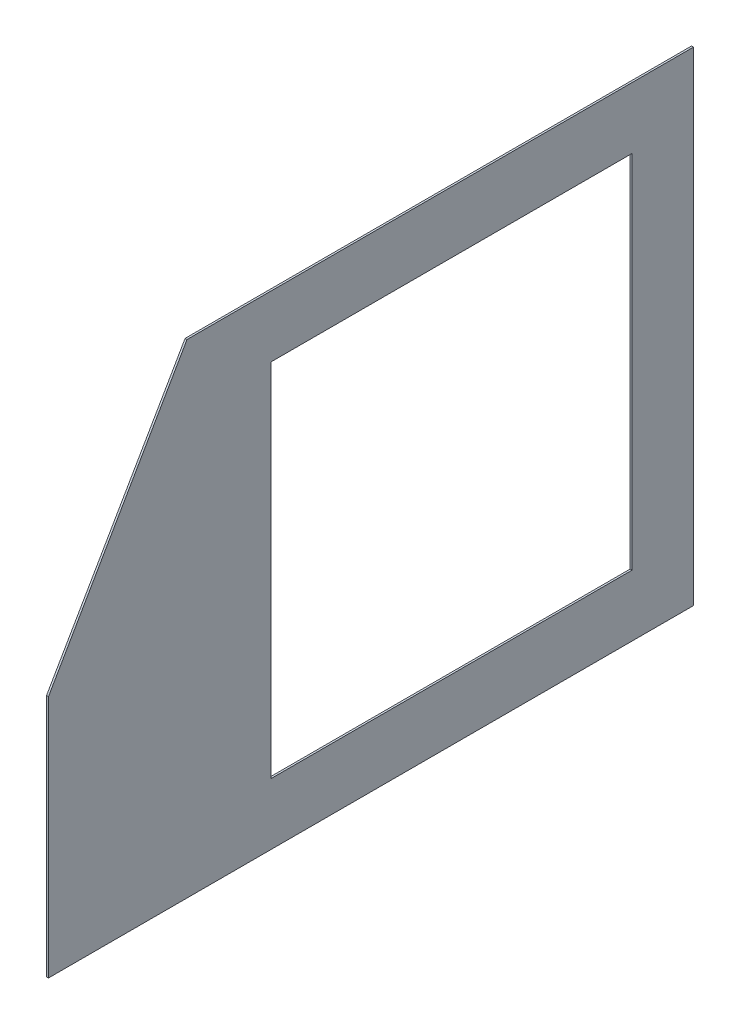
ISO-10303-21;
HEADER;
FILE_DESCRIPTION(('STEP AP214'),'2;1');
FILE_NAME('part.step','',(''),(''),'','','');
FILE_SCHEMA(('AUTOMOTIVE_DESIGN { 1 0 10303 214 1 1 1 1 }'));
ENDSEC;
DATA;
#1=APPLICATION_CONTEXT('core data for automotive mechanical design processes');
#2=APPLICATION_PROTOCOL_DEFINITION('international standard','automotive_design',2000,#1);
#3=PRODUCT_CONTEXT('',#1,'mechanical');
#4=PRODUCT('Part','Part','',(#3));
#5=PRODUCT_RELATED_PRODUCT_CATEGORY('part','',(#4));
#6=PRODUCT_DEFINITION_FORMATION('','',#4);
#7=PRODUCT_DEFINITION_CONTEXT('part definition',#1,'design');
#8=PRODUCT_DEFINITION('design','',#6,#7);
#9=PRODUCT_DEFINITION_SHAPE('','',#8);
#10=(LENGTH_UNIT() NAMED_UNIT(*) SI_UNIT(.MILLI.,.METRE.));
#11=(NAMED_UNIT(*) PLANE_ANGLE_UNIT() SI_UNIT($,.RADIAN.));
#12=(NAMED_UNIT(*) SI_UNIT($,.STERADIAN.) SOLID_ANGLE_UNIT());
#13=UNCERTAINTY_MEASURE_WITH_UNIT(LENGTH_MEASURE(1.E-05),#10,'distance_accuracy_value','');
#14=(GEOMETRIC_REPRESENTATION_CONTEXT(3) GLOBAL_UNCERTAINTY_ASSIGNED_CONTEXT((#13)) GLOBAL_UNIT_ASSIGNED_CONTEXT((#10,
#11,#12)) REPRESENTATION_CONTEXT('',''));
#15=CARTESIAN_POINT('',(0.,0.,0.));
#16=DIRECTION('',(0.,0.,1.));
#17=DIRECTION('',(1.,0.,0.));
#18=AXIS2_PLACEMENT_3D('',#15,#16,#17);
#19=CARTESIAN_POINT('',(3.175,-800.1,0.));
#20=DIRECTION('',(0.,0.,1.));
#21=DIRECTION('',(1.,0.,0.));
#22=AXIS2_PLACEMENT_3D('',#19,#20,#21);
#23=PLANE('',#22);
#24=DIRECTION('',(0.,1.,0.));
#25=VECTOR('',#24,1.);
#26=CARTESIAN_POINT('',(0.,-800.1,0.));
#27=LINE('',#26,#25);
#28=CARTESIAN_POINT('',(0.,-800.1,0.));
#29=VERTEX_POINT('',#28);
#30=CARTESIAN_POINT('',(0.,0.,0.));
#31=VERTEX_POINT('',#30);
#32=EDGE_CURVE('E117',#29,#31,#27,.T.);
#33=ORIENTED_EDGE('',*,*,#32,.T.);
#34=DIRECTION('',(-1.,0.,0.));
#35=VECTOR('',#34,1.);
#36=CARTESIAN_POINT('',(3.175,0.,0.));
#37=LINE('',#36,#35);
#38=CARTESIAN_POINT('',(3.175,0.,0.));
#39=VERTEX_POINT('',#38);
#40=EDGE_CURVE('E11',#39,#31,#37,.T.);
#41=ORIENTED_EDGE('',*,*,#40,.F.);
#42=DIRECTION('',(0.,1.,0.));
#43=VECTOR('',#42,1.);
#44=CARTESIAN_POINT('',(3.175,-800.1,0.));
#45=LINE('',#44,#43);
#46=CARTESIAN_POINT('',(3.175,-800.1,0.));
#47=VERTEX_POINT('',#46);
#48=EDGE_CURVE('E140',#47,#39,#45,.T.);
#49=ORIENTED_EDGE('',*,*,#48,.F.);
#50=DIRECTION('',(-1.,0.,0.));
#51=VECTOR('',#50,1.);
#52=CARTESIAN_POINT('',(3.175,-800.1,0.));
#53=LINE('',#52,#51);
#54=EDGE_CURVE('E152',#47,#29,#53,.T.);
#55=ORIENTED_EDGE('',*,*,#54,.T.);
#56=EDGE_LOOP('',(#33,#41,#49,#55));
#57=FACE_BOUND('',#56,.T.);
#58=ADVANCED_FACE('F33',(#57),#23,.F.);
#59=CARTESIAN_POINT('',(3.175,0.,0.));
#60=DIRECTION('',(0.,-1.,0.));
#61=DIRECTION('',(0.,0.,-1.));
#62=AXIS2_PLACEMENT_3D('',#59,#60,#61);
#63=PLANE('',#62);
#64=DIRECTION('',(0.,0.,1.));
#65=VECTOR('',#64,1.);
#66=CARTESIAN_POINT('',(0.,0.,0.));
#67=LINE('',#66,#65);
#68=CARTESIAN_POINT('',(0.,-1.02584267341776E-13,837.664111915367));
#69=VERTEX_POINT('',#68);
#70=EDGE_CURVE('E155',#31,#69,#67,.T.);
#71=ORIENTED_EDGE('',*,*,#70,.T.);
#72=DIRECTION('',(-1.,0.,0.));
#73=VECTOR('',#72,1.);
#74=CARTESIAN_POINT('',(3.175,-1.02584267341776E-13,837.664111915367));
#75=LINE('',#74,#73);
#76=CARTESIAN_POINT('',(3.175,-1.02584267341776E-13,837.664111915367));
#77=VERTEX_POINT('',#76);
#78=EDGE_CURVE('E40',#77,#69,#75,.T.);
#79=ORIENTED_EDGE('',*,*,#78,.F.);
#80=DIRECTION('',(0.,0.,1.));
#81=VECTOR('',#80,1.);
#82=CARTESIAN_POINT('',(3.175,0.,0.));
#83=LINE('',#82,#81);
#84=EDGE_CURVE('E143',#39,#77,#83,.T.);
#85=ORIENTED_EDGE('',*,*,#84,.F.);
#86=ORIENTED_EDGE('',*,*,#40,.T.);
#87=EDGE_LOOP('',(#71,#79,#85,#86));
#88=FACE_BOUND('',#87,.T.);
#89=ADVANCED_FACE('F192',(#88),#63,.F.);
#90=CARTESIAN_POINT('',(3.175,-1.02584267341776E-13,837.664111915367));
#91=DIRECTION('',(0.,-0.500000000000001,-0.866025403784438));
#92=DIRECTION('',(0.,0.866025403784438,-0.500000000000001));
#93=AXIS2_PLACEMENT_3D('',#90,#91,#92);
#94=PLANE('',#93);
#95=DIRECTION('',(0.,-0.866025403784438,0.500000000000001));
#96=VECTOR('',#95,1.);
#97=CARTESIAN_POINT('',(0.,-1.02584267341776E-13,837.664111915367));
#98=LINE('',#97,#96);
#99=CARTESIAN_POINT('',(0.,-396.875,1066.8));
#100=VERTEX_POINT('',#99);
#101=EDGE_CURVE('E157',#69,#100,#98,.T.);
#102=ORIENTED_EDGE('',*,*,#101,.T.);
#103=DIRECTION('',(-1.,0.,0.));
#104=VECTOR('',#103,1.);
#105=CARTESIAN_POINT('',(3.175,-396.875,1066.8));
#106=LINE('',#105,#104);
#107=CARTESIAN_POINT('',(3.175,-396.875,1066.8));
#108=VERTEX_POINT('',#107);
#109=EDGE_CURVE('E167',#108,#100,#106,.T.);
#110=ORIENTED_EDGE('',*,*,#109,.F.);
#111=DIRECTION('',(0.,-0.866025403784438,0.500000000000001));
#112=VECTOR('',#111,1.);
#113=CARTESIAN_POINT('',(3.175,-1.02584267341776E-13,837.664111915367));
#114=LINE('',#113,#112);
#115=EDGE_CURVE('E146',#77,#108,#114,.T.);
#116=ORIENTED_EDGE('',*,*,#115,.F.);
#117=ORIENTED_EDGE('',*,*,#78,.T.);
#118=EDGE_LOOP('',(#102,#110,#116,#117));
#119=FACE_BOUND('',#118,.T.);
#120=ADVANCED_FACE('F174',(#119),#94,.F.);
#121=CARTESIAN_POINT('',(3.175,-396.875,1066.8));
#122=DIRECTION('',(0.,0.,-1.));
#123=DIRECTION('',(-1.,0.,0.));
#124=AXIS2_PLACEMENT_3D('',#121,#122,#123);
#125=PLANE('',#124);
#126=DIRECTION('',(0.,-1.,0.));
#127=VECTOR('',#126,1.);
#128=CARTESIAN_POINT('',(0.,-396.875,1066.8));
#129=LINE('',#128,#127);
#130=CARTESIAN_POINT('',(0.,-800.1,1066.8));
#131=VERTEX_POINT('',#130);
#132=EDGE_CURVE('E159',#100,#131,#129,.T.);
#133=ORIENTED_EDGE('',*,*,#132,.T.);
#134=DIRECTION('',(-1.,0.,0.));
#135=VECTOR('',#134,1.);
#136=CARTESIAN_POINT('',(3.175,-800.1,1066.8));
#137=LINE('',#136,#135);
#138=CARTESIAN_POINT('',(3.175,-800.1,1066.8));
#139=VERTEX_POINT('',#138);
#140=EDGE_CURVE('E164',#139,#131,#137,.T.);
#141=ORIENTED_EDGE('',*,*,#140,.F.);
#142=DIRECTION('',(0.,-1.,0.));
#143=VECTOR('',#142,1.);
#144=CARTESIAN_POINT('',(3.175,-396.875,1066.8));
#145=LINE('',#144,#143);
#146=EDGE_CURVE('E148',#108,#139,#145,.T.);
#147=ORIENTED_EDGE('',*,*,#146,.F.);
#148=ORIENTED_EDGE('',*,*,#109,.T.);
#149=EDGE_LOOP('',(#133,#141,#147,#148));
#150=FACE_BOUND('',#149,.T.);
#151=ADVANCED_FACE('F182',(#150),#125,.F.);
#152=CARTESIAN_POINT('',(3.175,-800.1,1066.8));
#153=DIRECTION('',(0.,1.,0.));
#154=DIRECTION('',(0.,0.,1.));
#155=AXIS2_PLACEMENT_3D('',#152,#153,#154);
#156=PLANE('',#155);
#157=DIRECTION('',(0.,0.,-1.));
#158=VECTOR('',#157,1.);
#159=CARTESIAN_POINT('',(0.,-800.1,1066.8));
#160=LINE('',#159,#158);
#161=EDGE_CURVE('E144',#131,#29,#160,.T.);
#162=ORIENTED_EDGE('',*,*,#161,.T.);
#163=ORIENTED_EDGE('',*,*,#54,.F.);
#164=DIRECTION('',(0.,0.,-1.));
#165=VECTOR('',#164,1.);
#166=CARTESIAN_POINT('',(3.175,-800.1,1066.8));
#167=LINE('',#166,#165);
#168=EDGE_CURVE('E150',#139,#47,#167,.T.);
#169=ORIENTED_EDGE('',*,*,#168,.F.);
#170=ORIENTED_EDGE('',*,*,#140,.T.);
#171=EDGE_LOOP('',(#162,#163,#169,#170));
#172=FACE_BOUND('',#171,.T.);
#173=ADVANCED_FACE('F186',(#172),#156,.F.);
#174=CARTESIAN_POINT('',(3.175,0.,0.));
#175=DIRECTION('',(1.,0.,0.));
#176=DIRECTION('',(0.,0.,-1.));
#177=AXIS2_PLACEMENT_3D('',#174,#175,#176);
#178=PLANE('',#177);
#179=DIRECTION('',(0.,-1.,0.));
#180=VECTOR('',#179,1.);
#181=CARTESIAN_POINT('',(3.175,-101.6,698.5));
#182=LINE('',#181,#180);
#183=CARTESIAN_POINT('',(3.175,-101.6,698.5));
#184=VERTEX_POINT('',#183);
#185=CARTESIAN_POINT('',(3.175,-698.5,698.5));
#186=VERTEX_POINT('',#185);
#187=EDGE_CURVE('E47',#184,#186,#182,.T.);
#188=ORIENTED_EDGE('',*,*,#187,.F.);
#189=DIRECTION('',(0.,0.,1.));
#190=VECTOR('',#189,1.);
#191=CARTESIAN_POINT('',(3.175,-101.6,101.6));
#192=LINE('',#191,#190);
#193=CARTESIAN_POINT('',(3.175,-101.6,101.6));
#194=VERTEX_POINT('',#193);
#195=EDGE_CURVE('E111',#194,#184,#192,.T.);
#196=ORIENTED_EDGE('',*,*,#195,.F.);
#197=DIRECTION('',(0.,1.,0.));
#198=VECTOR('',#197,1.);
#199=CARTESIAN_POINT('',(3.175,-396.875,101.6));
#200=LINE('',#199,#198);
#201=CARTESIAN_POINT('',(3.175,-698.5,101.6));
#202=VERTEX_POINT('',#201);
#203=EDGE_CURVE('E131',#202,#194,#200,.T.);
#204=ORIENTED_EDGE('',*,*,#203,.F.);
#205=DIRECTION('',(0.,0.,-1.));
#206=VECTOR('',#205,1.);
#207=CARTESIAN_POINT('',(3.175,-698.5,698.5));
#208=LINE('',#207,#206);
#209=EDGE_CURVE('E125',#186,#202,#208,.T.);
#210=ORIENTED_EDGE('',*,*,#209,.F.);
#211=EDGE_LOOP('',(#188,#196,#204,#210));
#212=FACE_BOUND('',#211,.T.);
#213=ORIENTED_EDGE('',*,*,#48,.T.);
#214=ORIENTED_EDGE('',*,*,#84,.T.);
#215=ORIENTED_EDGE('',*,*,#115,.T.);
#216=ORIENTED_EDGE('',*,*,#146,.T.);
#217=ORIENTED_EDGE('',*,*,#168,.T.);
#218=EDGE_LOOP('',(#213,#214,#215,#216,#217));
#219=FACE_BOUND('',#218,.T.);
#220=ADVANCED_FACE('F190',(#212,#219),#178,.T.);
#221=CARTESIAN_POINT('',(0.,0.,0.));
#222=DIRECTION('',(1.,0.,0.));
#223=DIRECTION('',(0.,0.,-1.));
#224=AXIS2_PLACEMENT_3D('',#221,#222,#223);
#225=PLANE('',#224);
#226=DIRECTION('',(0.,0.,-1.));
#227=VECTOR('',#226,1.);
#228=CARTESIAN_POINT('',(0.,-101.6,101.6));
#229=LINE('',#228,#227);
#230=CARTESIAN_POINT('',(0.,-101.6,698.5));
#231=VERTEX_POINT('',#230);
#232=CARTESIAN_POINT('',(0.,-101.6,101.6));
#233=VERTEX_POINT('',#232);
#234=EDGE_CURVE('E123',#231,#233,#229,.T.);
#235=ORIENTED_EDGE('',*,*,#234,.F.);
#236=DIRECTION('',(0.,1.,0.));
#237=VECTOR('',#236,1.);
#238=CARTESIAN_POINT('',(0.,-101.6,698.5));
#239=LINE('',#238,#237);
#240=CARTESIAN_POINT('',(0.,-698.5,698.5));
#241=VERTEX_POINT('',#240);
#242=EDGE_CURVE('E105',#241,#231,#239,.T.);
#243=ORIENTED_EDGE('',*,*,#242,.F.);
#244=DIRECTION('',(0.,0.,1.));
#245=VECTOR('',#244,1.);
#246=CARTESIAN_POINT('',(0.,-698.5,698.5));
#247=LINE('',#246,#245);
#248=CARTESIAN_POINT('',(0.,-698.5,101.6));
#249=VERTEX_POINT('',#248);
#250=EDGE_CURVE('E114',#249,#241,#247,.T.);
#251=ORIENTED_EDGE('',*,*,#250,.F.);
#252=DIRECTION('',(0.,-1.,0.));
#253=VECTOR('',#252,1.);
#254=CARTESIAN_POINT('',(0.,-396.875,101.6));
#255=LINE('',#254,#253);
#256=EDGE_CURVE('E55',#233,#249,#255,.T.);
#257=ORIENTED_EDGE('',*,*,#256,.F.);
#258=EDGE_LOOP('',(#235,#243,#251,#257));
#259=FACE_BOUND('',#258,.T.);
#260=ORIENTED_EDGE('',*,*,#32,.F.);
#261=ORIENTED_EDGE('',*,*,#161,.F.);
#262=ORIENTED_EDGE('',*,*,#132,.F.);
#263=ORIENTED_EDGE('',*,*,#101,.F.);
#264=ORIENTED_EDGE('',*,*,#70,.F.);
#265=EDGE_LOOP('',(#260,#261,#262,#263,#264));
#266=FACE_BOUND('',#265,.T.);
#267=ADVANCED_FACE('F120',(#259,#266),#225,.F.);
#268=CARTESIAN_POINT('',(-0.00100000000000013,-101.6,698.5));
#269=DIRECTION('',(0.,0.,1.));
#270=DIRECTION('',(0.,-1.,0.));
#271=AXIS2_PLACEMENT_3D('',#268,#269,#270);
#272=PLANE('',#271);
#273=ORIENTED_EDGE('',*,*,#242,.T.);
#274=DIRECTION('',(1.,0.,0.));
#275=VECTOR('',#274,1.);
#276=CARTESIAN_POINT('',(-0.00100000000000013,-101.6,698.5));
#277=LINE('',#276,#275);
#278=EDGE_CURVE('E118',#231,#184,#277,.T.);
#279=ORIENTED_EDGE('',*,*,#278,.T.);
#280=ORIENTED_EDGE('',*,*,#187,.T.);
#281=DIRECTION('',(1.,0.,0.));
#282=VECTOR('',#281,1.);
#283=CARTESIAN_POINT('',(-0.00100000000000013,-698.5,698.5));
#284=LINE('',#283,#282);
#285=EDGE_CURVE('E101',#241,#186,#284,.T.);
#286=ORIENTED_EDGE('',*,*,#285,.F.);
#287=EDGE_LOOP('',(#273,#279,#280,#286));
#288=FACE_BOUND('',#287,.T.);
#289=ADVANCED_FACE('F103',(#288),#272,.F.);
#290=CARTESIAN_POINT('',(-0.00100000000000013,-101.6,101.6));
#291=DIRECTION('',(0.,1.,0.));
#292=DIRECTION('',(0.,0.,1.));
#293=AXIS2_PLACEMENT_3D('',#290,#291,#292);
#294=PLANE('',#293);
#295=ORIENTED_EDGE('',*,*,#234,.T.);
#296=DIRECTION('',(1.,0.,0.));
#297=VECTOR('',#296,1.);
#298=CARTESIAN_POINT('',(-0.00100000000000013,-101.6,101.6));
#299=LINE('',#298,#297);
#300=EDGE_CURVE('E137',#233,#194,#299,.T.);
#301=ORIENTED_EDGE('',*,*,#300,.T.);
#302=ORIENTED_EDGE('',*,*,#195,.T.);
#303=ORIENTED_EDGE('',*,*,#278,.F.);
#304=EDGE_LOOP('',(#295,#301,#302,#303));
#305=FACE_BOUND('',#304,.T.);
#306=ADVANCED_FACE('F214',(#305),#294,.F.);
#307=CARTESIAN_POINT('',(-0.00100000000000013,-396.875,101.6));
#308=DIRECTION('',(0.,0.,-1.));
#309=DIRECTION('',(-1.,0.,0.));
#310=AXIS2_PLACEMENT_3D('',#307,#308,#309);
#311=PLANE('',#310);
#312=ORIENTED_EDGE('',*,*,#256,.T.);
#313=DIRECTION('',(1.,0.,0.));
#314=VECTOR('',#313,1.);
#315=CARTESIAN_POINT('',(-0.00100000000000013,-698.5,101.6));
#316=LINE('',#315,#314);
#317=EDGE_CURVE('E110',#249,#202,#316,.T.);
#318=ORIENTED_EDGE('',*,*,#317,.T.);
#319=ORIENTED_EDGE('',*,*,#203,.T.);
#320=ORIENTED_EDGE('',*,*,#300,.F.);
#321=EDGE_LOOP('',(#312,#318,#319,#320));
#322=FACE_BOUND('',#321,.T.);
#323=ADVANCED_FACE('F217',(#322),#311,.F.);
#324=CARTESIAN_POINT('',(-0.00100000000000013,-698.5,698.5));
#325=DIRECTION('',(0.,-1.,0.));
#326=DIRECTION('',(0.,0.,-1.));
#327=AXIS2_PLACEMENT_3D('',#324,#325,#326);
#328=PLANE('',#327);
#329=ORIENTED_EDGE('',*,*,#250,.T.);
#330=ORIENTED_EDGE('',*,*,#285,.T.);
#331=ORIENTED_EDGE('',*,*,#209,.T.);
#332=ORIENTED_EDGE('',*,*,#317,.F.);
#333=EDGE_LOOP('',(#329,#330,#331,#332));
#334=FACE_BOUND('',#333,.T.);
#335=ADVANCED_FACE('F115',(#334),#328,.F.);
#336=CLOSED_SHELL('',(#58,#89,#120,#151,#173,#220,#267,#289,#306,#323,#335));
#337=MANIFOLD_SOLID_BREP('B2',#336);
#338=ADVANCED_BREP_SHAPE_REPRESENTATION('',(#18,#337),#14);
#339=SHAPE_DEFINITION_REPRESENTATION(#9,#338);
ENDSEC;
END-ISO-10303-21;
